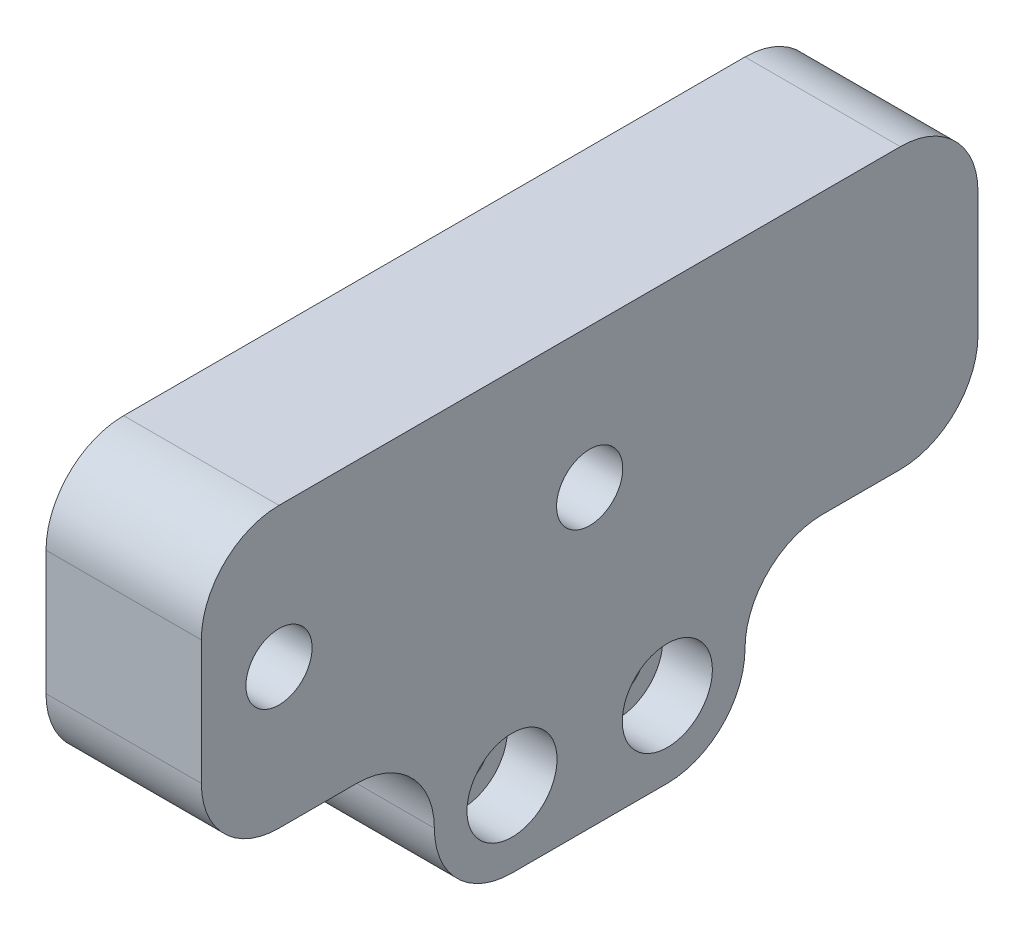
ISO-10303-21;
HEADER;
FILE_DESCRIPTION(('STEP AP214'),'2;1');
FILE_NAME('part.step','',(''),(''),'','','');
FILE_SCHEMA(('AUTOMOTIVE_DESIGN { 1 0 10303 214 1 1 1 1 }'));
ENDSEC;
DATA;
#1=APPLICATION_CONTEXT('core data for automotive mechanical design processes');
#2=APPLICATION_PROTOCOL_DEFINITION('international standard','automotive_design',2000,#1);
#3=PRODUCT_CONTEXT('',#1,'mechanical');
#4=PRODUCT('Part','Part','',(#3));
#5=PRODUCT_RELATED_PRODUCT_CATEGORY('part','',(#4));
#6=PRODUCT_DEFINITION_FORMATION('','',#4);
#7=PRODUCT_DEFINITION_CONTEXT('part definition',#1,'design');
#8=PRODUCT_DEFINITION('design','',#6,#7);
#9=PRODUCT_DEFINITION_SHAPE('','',#8);
#10=(LENGTH_UNIT() NAMED_UNIT(*) SI_UNIT(.MILLI.,.METRE.));
#11=(NAMED_UNIT(*) PLANE_ANGLE_UNIT() SI_UNIT($,.RADIAN.));
#12=(NAMED_UNIT(*) SI_UNIT($,.STERADIAN.) SOLID_ANGLE_UNIT());
#13=UNCERTAINTY_MEASURE_WITH_UNIT(LENGTH_MEASURE(1.E-05),#10,'distance_accuracy_value','');
#14=(GEOMETRIC_REPRESENTATION_CONTEXT(3) GLOBAL_UNCERTAINTY_ASSIGNED_CONTEXT((#13)) GLOBAL_UNIT_ASSIGNED_CONTEXT((#10,
#11,#12)) REPRESENTATION_CONTEXT('',''));
#15=CARTESIAN_POINT('',(0.,0.,0.));
#16=DIRECTION('',(0.,0.,1.));
#17=DIRECTION('',(1.,0.,0.));
#18=AXIS2_PLACEMENT_3D('',#15,#16,#17);
#19=CARTESIAN_POINT('',(6.35,-6.47700000000007,-6.35));
#20=DIRECTION('',(-1.,0.,0.));
#21=DIRECTION('',(0.,-1.,0.));
#22=AXIS2_PLACEMENT_3D('',#19,#20,#21);
#23=CYLINDRICAL_SURFACE('',#22,2.159);
#24=CARTESIAN_POINT('',(-19.05,-6.47700000000006,-6.35));
#25=DIRECTION('',(-1.,0.,0.));
#26=DIRECTION('',(0.,-1.,0.));
#27=AXIS2_PLACEMENT_3D('',#24,#25,#26);
#28=CIRCLE('',#27,2.159);
#29=CARTESIAN_POINT('',(-19.05,-8.63600000000006,-6.35));
#30=VERTEX_POINT('',#29);
#31=EDGE_CURVE('E198',#30,#30,#28,.T.);
#32=ORIENTED_EDGE('',*,*,#31,.T.);
#33=EDGE_LOOP('',(#32));
#34=FACE_BOUND('',#33,.T.);
#35=CARTESIAN_POINT('',(2.286,-6.47700000000007,-6.35));
#36=DIRECTION('',(1.,0.,0.));
#37=DIRECTION('',(0.,1.,0.));
#38=AXIS2_PLACEMENT_3D('',#35,#36,#37);
#39=CIRCLE('',#38,2.159);
#40=CARTESIAN_POINT('',(2.286,-4.31800000000006,-6.35));
#41=VERTEX_POINT('',#40);
#42=EDGE_CURVE('E201',#41,#41,#39,.F.);
#43=ORIENTED_EDGE('',*,*,#42,.F.);
#44=EDGE_LOOP('',(#43));
#45=FACE_BOUND('',#44,.T.);
#46=ADVANCED_FACE('F38',(#34,#45),#23,.F.);
#47=CARTESIAN_POINT('',(6.35,-6.47700000000007,6.35));
#48=DIRECTION('',(-1.,0.,0.));
#49=DIRECTION('',(0.,-1.,0.));
#50=AXIS2_PLACEMENT_3D('',#47,#48,#49);
#51=CYLINDRICAL_SURFACE('',#50,2.159);
#52=CARTESIAN_POINT('',(-19.05,-6.47700000000006,6.35));
#53=DIRECTION('',(-1.,0.,0.));
#54=DIRECTION('',(0.,-1.,0.));
#55=AXIS2_PLACEMENT_3D('',#52,#53,#54);
#56=CIRCLE('',#55,2.159);
#57=CARTESIAN_POINT('',(-19.05,-8.63600000000006,6.35));
#58=VERTEX_POINT('',#57);
#59=EDGE_CURVE('E180',#58,#58,#56,.T.);
#60=ORIENTED_EDGE('',*,*,#59,.T.);
#61=EDGE_LOOP('',(#60));
#62=FACE_BOUND('',#61,.T.);
#63=CARTESIAN_POINT('',(2.286,-6.47700000000007,6.35));
#64=DIRECTION('',(1.,0.,0.));
#65=DIRECTION('',(0.,1.,0.));
#66=AXIS2_PLACEMENT_3D('',#63,#64,#65);
#67=CIRCLE('',#66,2.159);
#68=CARTESIAN_POINT('',(2.286,-4.31800000000007,6.35));
#69=VERTEX_POINT('',#68);
#70=EDGE_CURVE('E302',#69,#69,#67,.T.);
#71=ORIENTED_EDGE('',*,*,#70,.T.);
#72=EDGE_LOOP('',(#71));
#73=FACE_BOUND('',#72,.T.);
#74=ADVANCED_FACE('F437',(#62,#73),#51,.F.);
#75=CARTESIAN_POINT('',(6.35,0.,12.7));
#76=DIRECTION('',(1.,0.,0.));
#77=DIRECTION('',(0.,1.,0.));
#78=AXIS2_PLACEMENT_3D('',#75,#76,#77);
#79=PLANE('',#78);
#80=CARTESIAN_POINT('',(6.35,11.43,25.4));
#81=DIRECTION('',(1.,0.,0.));
#82=DIRECTION('',(0.,1.,0.));
#83=AXIS2_PLACEMENT_3D('',#80,#81,#82);
#84=CIRCLE('',#83,2.7051);
#85=CARTESIAN_POINT('',(6.35,14.1351,25.4));
#86=VERTEX_POINT('',#85);
#87=EDGE_CURVE('E387',#86,#86,#84,.T.);
#88=ORIENTED_EDGE('',*,*,#87,.F.);
#89=EDGE_LOOP('',(#88));
#90=FACE_BOUND('',#89,.T.);
#91=CARTESIAN_POINT('',(6.35,11.43,0.));
#92=DIRECTION('',(1.,0.,0.));
#93=DIRECTION('',(0.,1.,0.));
#94=AXIS2_PLACEMENT_3D('',#91,#92,#93);
#95=CIRCLE('',#94,2.7051);
#96=CARTESIAN_POINT('',(6.35,14.1351,0.));
#97=VERTEX_POINT('',#96);
#98=EDGE_CURVE('E383',#97,#97,#95,.T.);
#99=ORIENTED_EDGE('',*,*,#98,.F.);
#100=EDGE_LOOP('',(#99));
#101=FACE_BOUND('',#100,.T.);
#102=DIRECTION('',(0.,0.,-1.));
#103=VECTOR('',#102,1.);
#104=CARTESIAN_POINT('',(6.35,-12.7,12.7));
#105=LINE('',#104,#103);
#106=CARTESIAN_POINT('',(6.35,-12.7,6.35));
#107=VERTEX_POINT('',#106);
#108=CARTESIAN_POINT('',(6.35,-12.7,-6.35));
#109=VERTEX_POINT('',#108);
#110=EDGE_CURVE('E185',#107,#109,#105,.T.);
#111=ORIENTED_EDGE('',*,*,#110,.T.);
#112=CARTESIAN_POINT('',(6.35,-6.35,-6.35));
#113=DIRECTION('',(1.,0.,0.));
#114=DIRECTION('',(0.,1.,0.));
#115=AXIS2_PLACEMENT_3D('',#112,#113,#114);
#116=CIRCLE('',#115,6.35);
#117=CARTESIAN_POINT('',(6.35,-6.35,-12.7));
#118=VERTEX_POINT('',#117);
#119=EDGE_CURVE('E221',#109,#118,#116,.T.);
#120=ORIENTED_EDGE('',*,*,#119,.T.);
#121=CARTESIAN_POINT('',(6.35,-6.35,-19.05));
#122=DIRECTION('',(1.,0.,0.));
#123=DIRECTION('',(0.,1.,0.));
#124=AXIS2_PLACEMENT_3D('',#121,#122,#123);
#125=CIRCLE('',#124,6.35);
#126=CARTESIAN_POINT('',(6.35,0.,-19.05));
#127=VERTEX_POINT('',#126);
#128=EDGE_CURVE('E261',#118,#127,#125,.F.);
#129=ORIENTED_EDGE('',*,*,#128,.T.);
#130=DIRECTION('',(0.,0.,1.));
#131=VECTOR('',#130,1.);
#132=CARTESIAN_POINT('',(6.35,0.,-31.75));
#133=LINE('',#132,#131);
#134=CARTESIAN_POINT('',(6.35,0.,-25.4));
#135=VERTEX_POINT('',#134);
#136=EDGE_CURVE('E316',#135,#127,#133,.T.);
#137=ORIENTED_EDGE('',*,*,#136,.F.);
#138=CARTESIAN_POINT('',(6.35,6.35,-25.4));
#139=DIRECTION('',(1.,0.,0.));
#140=DIRECTION('',(0.,1.,0.));
#141=AXIS2_PLACEMENT_3D('',#138,#139,#140);
#142=CIRCLE('',#141,6.35);
#143=CARTESIAN_POINT('',(6.35,6.35,-31.75));
#144=VERTEX_POINT('',#143);
#145=EDGE_CURVE('E211',#135,#144,#142,.T.);
#146=ORIENTED_EDGE('',*,*,#145,.T.);
#147=DIRECTION('',(0.,1.,0.));
#148=VECTOR('',#147,1.);
#149=CARTESIAN_POINT('',(6.35,0.,-31.75));
#150=LINE('',#149,#148);
#151=CARTESIAN_POINT('',(6.34999999999999,16.51,-31.75));
#152=VERTEX_POINT('',#151);
#153=EDGE_CURVE('E294',#144,#152,#150,.T.);
#154=ORIENTED_EDGE('',*,*,#153,.T.);
#155=CARTESIAN_POINT('',(6.34999999999999,16.51,-25.4));
#156=DIRECTION('',(1.,0.,0.));
#157=DIRECTION('',(0.,1.,0.));
#158=AXIS2_PLACEMENT_3D('',#155,#156,#157);
#159=CIRCLE('',#158,6.35);
#160=CARTESIAN_POINT('',(6.34999999999999,22.86,-25.4));
#161=VERTEX_POINT('',#160);
#162=EDGE_CURVE('E213',#152,#161,#159,.T.);
#163=ORIENTED_EDGE('',*,*,#162,.T.);
#164=DIRECTION('',(0.,0.,-1.));
#165=VECTOR('',#164,1.);
#166=CARTESIAN_POINT('',(6.34999999999999,22.86,12.7));
#167=LINE('',#166,#165);
#168=CARTESIAN_POINT('',(6.34999999999999,22.86,25.4));
#169=VERTEX_POINT('',#168);
#170=EDGE_CURVE('E188',#169,#161,#167,.T.);
#171=ORIENTED_EDGE('',*,*,#170,.F.);
#172=CARTESIAN_POINT('',(6.34999999999999,16.51,25.4));
#173=DIRECTION('',(1.,0.,0.));
#174=DIRECTION('',(0.,1.,0.));
#175=AXIS2_PLACEMENT_3D('',#172,#173,#174);
#176=CIRCLE('',#175,6.35);
#177=CARTESIAN_POINT('',(6.34999999999999,16.51,31.75));
#178=VERTEX_POINT('',#177);
#179=EDGE_CURVE('E215',#169,#178,#176,.T.);
#180=ORIENTED_EDGE('',*,*,#179,.T.);
#181=DIRECTION('',(0.,1.,0.));
#182=VECTOR('',#181,1.);
#183=CARTESIAN_POINT('',(6.35,0.,31.75));
#184=LINE('',#183,#182);
#185=CARTESIAN_POINT('',(6.35,6.35,31.75));
#186=VERTEX_POINT('',#185);
#187=EDGE_CURVE('E368',#186,#178,#184,.T.);
#188=ORIENTED_EDGE('',*,*,#187,.F.);
#189=CARTESIAN_POINT('',(6.35,6.35,25.4));
#190=DIRECTION('',(1.,0.,0.));
#191=DIRECTION('',(0.,1.,0.));
#192=AXIS2_PLACEMENT_3D('',#189,#190,#191);
#193=CIRCLE('',#192,6.35);
#194=CARTESIAN_POINT('',(6.35,0.,25.4));
#195=VERTEX_POINT('',#194);
#196=EDGE_CURVE('E217',#186,#195,#193,.T.);
#197=ORIENTED_EDGE('',*,*,#196,.T.);
#198=CARTESIAN_POINT('',(6.35,0.,19.05));
#199=VERTEX_POINT('',#198);
#200=EDGE_CURVE('E296',#199,#195,#133,.T.);
#201=ORIENTED_EDGE('',*,*,#200,.F.);
#202=CARTESIAN_POINT('',(6.35,-6.35,19.05));
#203=DIRECTION('',(1.,0.,0.));
#204=DIRECTION('',(0.,1.,0.));
#205=AXIS2_PLACEMENT_3D('',#202,#203,#204);
#206=CIRCLE('',#205,6.35);
#207=CARTESIAN_POINT('',(6.35,-6.35,12.7));
#208=VERTEX_POINT('',#207);
#209=EDGE_CURVE('E47',#199,#208,#206,.F.);
#210=ORIENTED_EDGE('',*,*,#209,.T.);
#211=CARTESIAN_POINT('',(6.35,-6.35,6.35));
#212=DIRECTION('',(1.,0.,0.));
#213=DIRECTION('',(0.,1.,0.));
#214=AXIS2_PLACEMENT_3D('',#211,#212,#213);
#215=CIRCLE('',#214,6.35);
#216=EDGE_CURVE('E219',#208,#107,#215,.T.);
#217=ORIENTED_EDGE('',*,*,#216,.T.);
#218=EDGE_LOOP('',(#111,#120,#129,#137,#146,#154,#163,#171,#180,#188,#197,#201,#210,#217));
#219=FACE_BOUND('',#218,.T.);
#220=CARTESIAN_POINT('',(6.35,-6.47700000000007,6.35));
#221=DIRECTION('',(1.,0.,0.));
#222=DIRECTION('',(0.,1.,0.));
#223=AXIS2_PLACEMENT_3D('',#220,#221,#222);
#224=CIRCLE('',#223,3.683);
#225=CARTESIAN_POINT('',(6.35,-2.79400000000007,6.35));
#226=VERTEX_POINT('',#225);
#227=EDGE_CURVE('E305',#226,#226,#224,.T.);
#228=ORIENTED_EDGE('',*,*,#227,.F.);
#229=EDGE_LOOP('',(#228));
#230=FACE_BOUND('',#229,.T.);
#231=CARTESIAN_POINT('',(6.35,-6.47700000000007,-6.35));
#232=DIRECTION('',(1.,0.,0.));
#233=DIRECTION('',(0.,1.,0.));
#234=AXIS2_PLACEMENT_3D('',#231,#232,#233);
#235=CIRCLE('',#234,3.683);
#236=CARTESIAN_POINT('',(6.35,-2.79400000000007,-6.35));
#237=VERTEX_POINT('',#236);
#238=EDGE_CURVE('E306',#237,#237,#235,.T.);
#239=ORIENTED_EDGE('',*,*,#238,.F.);
#240=EDGE_LOOP('',(#239));
#241=FACE_BOUND('',#240,.T.);
#242=ADVANCED_FACE('F335',(#90,#101,#219,#230,#241),#79,.T.);
#243=CARTESIAN_POINT('',(0.,22.86,12.7));
#244=DIRECTION('',(0.,1.,0.));
#245=DIRECTION('',(0.,0.,1.));
#246=AXIS2_PLACEMENT_3D('',#243,#244,#245);
#247=PLANE('',#246);
#248=DIRECTION('',(0.,0.,-1.));
#249=VECTOR('',#248,1.);
#250=CARTESIAN_POINT('',(-6.35000000000001,22.86,12.7));
#251=LINE('',#250,#249);
#252=CARTESIAN_POINT('',(-6.35000000000001,22.86,25.4));
#253=VERTEX_POINT('',#252);
#254=CARTESIAN_POINT('',(-6.35000000000001,22.86,-25.4));
#255=VERTEX_POINT('',#254);
#256=EDGE_CURVE('E184',#253,#255,#251,.T.);
#257=ORIENTED_EDGE('',*,*,#256,.F.);
#258=DIRECTION('',(-1.,0.,0.));
#259=VECTOR('',#258,1.);
#260=CARTESIAN_POINT('',(0.,22.86,25.4));
#261=LINE('',#260,#259);
#262=EDGE_CURVE('E251',#253,#169,#261,.F.);
#263=ORIENTED_EDGE('',*,*,#262,.T.);
#264=ORIENTED_EDGE('',*,*,#170,.T.);
#265=DIRECTION('',(-1.,0.,0.));
#266=VECTOR('',#265,1.);
#267=CARTESIAN_POINT('',(-6.35000000000001,22.86,-25.4));
#268=LINE('',#267,#266);
#269=EDGE_CURVE('E248',#161,#255,#268,.T.);
#270=ORIENTED_EDGE('',*,*,#269,.T.);
#271=EDGE_LOOP('',(#257,#263,#264,#270));
#272=FACE_BOUND('',#271,.T.);
#273=ADVANCED_FACE('F362',(#272),#247,.T.);
#274=CARTESIAN_POINT('',(-6.35,0.,12.7));
#275=DIRECTION('',(1.,0.,0.));
#276=DIRECTION('',(0.,1.,0.));
#277=AXIS2_PLACEMENT_3D('',#274,#275,#276);
#278=PLANE('',#277);
#279=CARTESIAN_POINT('',(-6.35,5.08,-26.67));
#280=DIRECTION('',(-1.,0.,0.));
#281=DIRECTION('',(0.,-1.,0.));
#282=AXIS2_PLACEMENT_3D('',#279,#280,#281);
#283=CIRCLE('',#282,1.143);
#284=CARTESIAN_POINT('',(-6.35,3.937,-26.67));
#285=VERTEX_POINT('',#284);
#286=EDGE_CURVE('E272',#285,#285,#283,.T.);
#287=ORIENTED_EDGE('',*,*,#286,.F.);
#288=EDGE_LOOP('',(#287));
#289=FACE_BOUND('',#288,.T.);
#290=CARTESIAN_POINT('',(-6.35,5.08000000000001,-6.35000000000002));
#291=DIRECTION('',(-1.,0.,0.));
#292=DIRECTION('',(0.,-1.,0.));
#293=AXIS2_PLACEMENT_3D('',#290,#291,#292);
#294=CIRCLE('',#293,1.143);
#295=CARTESIAN_POINT('',(-6.35,3.93700000000001,-6.35000000000002));
#296=VERTEX_POINT('',#295);
#297=EDGE_CURVE('E403',#296,#296,#294,.T.);
#298=ORIENTED_EDGE('',*,*,#297,.F.);
#299=EDGE_LOOP('',(#298));
#300=FACE_BOUND('',#299,.T.);
#301=CARTESIAN_POINT('',(-6.35000000000001,17.78,-6.35000000000002));
#302=DIRECTION('',(-1.,0.,0.));
#303=DIRECTION('',(0.,-1.,0.));
#304=AXIS2_PLACEMENT_3D('',#301,#302,#303);
#305=CIRCLE('',#304,1.143);
#306=CARTESIAN_POINT('',(-6.35000000000001,16.637,-6.35000000000002));
#307=VERTEX_POINT('',#306);
#308=EDGE_CURVE('E395',#307,#307,#305,.T.);
#309=ORIENTED_EDGE('',*,*,#308,.F.);
#310=EDGE_LOOP('',(#309));
#311=FACE_BOUND('',#310,.T.);
#312=CARTESIAN_POINT('',(-6.35000000000001,17.78,-26.67));
#313=DIRECTION('',(-1.,0.,0.));
#314=DIRECTION('',(0.,-1.,0.));
#315=AXIS2_PLACEMENT_3D('',#312,#313,#314);
#316=CIRCLE('',#315,1.143);
#317=CARTESIAN_POINT('',(-6.35000000000001,16.637,-26.67));
#318=VERTEX_POINT('',#317);
#319=EDGE_CURVE('E392',#318,#318,#316,.T.);
#320=ORIENTED_EDGE('',*,*,#319,.F.);
#321=EDGE_LOOP('',(#320));
#322=FACE_BOUND('',#321,.T.);
#323=DIRECTION('',(0.,0.,1.));
#324=VECTOR('',#323,1.);
#325=CARTESIAN_POINT('',(-6.35,0.,-31.75));
#326=LINE('',#325,#324);
#327=CARTESIAN_POINT('',(-6.35,0.,19.05));
#328=VERTEX_POINT('',#327);
#329=CARTESIAN_POINT('',(-6.35,0.,25.4));
#330=VERTEX_POINT('',#329);
#331=EDGE_CURVE('E286',#328,#330,#326,.T.);
#332=ORIENTED_EDGE('',*,*,#331,.T.);
#333=CARTESIAN_POINT('',(-6.35,6.35,25.4));
#334=DIRECTION('',(1.,0.,0.));
#335=DIRECTION('',(0.,1.,0.));
#336=AXIS2_PLACEMENT_3D('',#333,#334,#335);
#337=CIRCLE('',#336,6.35);
#338=CARTESIAN_POINT('',(-6.35,6.35,31.75));
#339=VERTEX_POINT('',#338);
#340=EDGE_CURVE('E246',#330,#339,#337,.F.);
#341=ORIENTED_EDGE('',*,*,#340,.T.);
#342=DIRECTION('',(0.,-1.,0.));
#343=VECTOR('',#342,1.);
#344=CARTESIAN_POINT('',(-6.35,0.,31.75));
#345=LINE('',#344,#343);
#346=CARTESIAN_POINT('',(-6.35000000000001,16.51,31.75));
#347=VERTEX_POINT('',#346);
#348=EDGE_CURVE('E374',#347,#339,#345,.T.);
#349=ORIENTED_EDGE('',*,*,#348,.F.);
#350=CARTESIAN_POINT('',(-6.35000000000001,16.51,25.4));
#351=DIRECTION('',(1.,0.,0.));
#352=DIRECTION('',(0.,1.,0.));
#353=AXIS2_PLACEMENT_3D('',#350,#351,#352);
#354=CIRCLE('',#353,6.35);
#355=EDGE_CURVE('E244',#347,#253,#354,.F.);
#356=ORIENTED_EDGE('',*,*,#355,.T.);
#357=ORIENTED_EDGE('',*,*,#256,.T.);
#358=CARTESIAN_POINT('',(-6.35000000000001,16.51,-25.4));
#359=DIRECTION('',(1.,0.,0.));
#360=DIRECTION('',(0.,1.,0.));
#361=AXIS2_PLACEMENT_3D('',#358,#359,#360);
#362=CIRCLE('',#361,6.35);
#363=CARTESIAN_POINT('',(-6.35000000000001,16.51,-31.75));
#364=VERTEX_POINT('',#363);
#365=EDGE_CURVE('E242',#255,#364,#362,.F.);
#366=ORIENTED_EDGE('',*,*,#365,.T.);
#367=DIRECTION('',(0.,-1.,0.));
#368=VECTOR('',#367,1.);
#369=CARTESIAN_POINT('',(-6.35,0.,-31.75));
#370=LINE('',#369,#368);
#371=CARTESIAN_POINT('',(-6.35,6.35,-31.75));
#372=VERTEX_POINT('',#371);
#373=EDGE_CURVE('E298',#364,#372,#370,.T.);
#374=ORIENTED_EDGE('',*,*,#373,.T.);
#375=CARTESIAN_POINT('',(-6.35,6.35,-25.4));
#376=DIRECTION('',(1.,0.,0.));
#377=DIRECTION('',(0.,1.,0.));
#378=AXIS2_PLACEMENT_3D('',#375,#376,#377);
#379=CIRCLE('',#378,6.35);
#380=CARTESIAN_POINT('',(-6.35,0.,-25.4));
#381=VERTEX_POINT('',#380);
#382=EDGE_CURVE('E240',#372,#381,#379,.F.);
#383=ORIENTED_EDGE('',*,*,#382,.T.);
#384=CARTESIAN_POINT('',(-6.35,0.,-19.05));
#385=VERTEX_POINT('',#384);
#386=EDGE_CURVE('E293',#381,#385,#326,.T.);
#387=ORIENTED_EDGE('',*,*,#386,.T.);
#388=CARTESIAN_POINT('',(-6.35,-6.35,-19.05));
#389=DIRECTION('',(1.,0.,0.));
#390=DIRECTION('',(0.,1.,0.));
#391=AXIS2_PLACEMENT_3D('',#388,#389,#390);
#392=CIRCLE('',#391,6.35);
#393=CARTESIAN_POINT('',(-6.35,-6.35,-12.7));
#394=VERTEX_POINT('',#393);
#395=EDGE_CURVE('E263',#385,#394,#392,.T.);
#396=ORIENTED_EDGE('',*,*,#395,.T.);
#397=DIRECTION('',(0.,-1.,0.));
#398=VECTOR('',#397,1.);
#399=CARTESIAN_POINT('',(-6.35,0.,-12.7));
#400=LINE('',#399,#398);
#401=CARTESIAN_POINT('',(-6.35,0.,-12.7));
#402=VERTEX_POINT('',#401);
#403=EDGE_CURVE('E55',#402,#394,#400,.T.);
#404=ORIENTED_EDGE('',*,*,#403,.F.);
#405=DIRECTION('',(0.,0.,-1.));
#406=VECTOR('',#405,1.);
#407=CARTESIAN_POINT('',(-6.35,0.,12.7));
#408=LINE('',#407,#406);
#409=CARTESIAN_POINT('',(-6.35,0.,12.7));
#410=VERTEX_POINT('',#409);
#411=EDGE_CURVE('E175',#410,#402,#408,.T.);
#412=ORIENTED_EDGE('',*,*,#411,.F.);
#413=DIRECTION('',(0.,1.,0.));
#414=VECTOR('',#413,1.);
#415=CARTESIAN_POINT('',(-6.35,0.,12.7));
#416=LINE('',#415,#414);
#417=CARTESIAN_POINT('',(-6.35,-6.35,12.7));
#418=VERTEX_POINT('',#417);
#419=EDGE_CURVE('E161',#418,#410,#416,.T.);
#420=ORIENTED_EDGE('',*,*,#419,.F.);
#421=CARTESIAN_POINT('',(-6.35,-6.35,19.05));
#422=DIRECTION('',(1.,0.,0.));
#423=DIRECTION('',(0.,1.,0.));
#424=AXIS2_PLACEMENT_3D('',#421,#422,#423);
#425=CIRCLE('',#424,6.35);
#426=EDGE_CURVE('E11',#418,#328,#425,.T.);
#427=ORIENTED_EDGE('',*,*,#426,.T.);
#428=EDGE_LOOP('',(#332,#341,#349,#356,#357,#366,#374,#383,#387,#396,#404,#412,#420,#427));
#429=FACE_BOUND('',#428,.T.);
#430=ADVANCED_FACE('F183',(#289,#300,#311,#322,#429),#278,.F.);
#431=CARTESIAN_POINT('',(0.,-12.7,12.7));
#432=DIRECTION('',(0.,1.,0.));
#433=DIRECTION('',(-1.,0.,0.));
#434=AXIS2_PLACEMENT_3D('',#431,#432,#433);
#435=PLANE('',#434);
#436=DIRECTION('',(0.,0.,1.));
#437=VECTOR('',#436,1.);
#438=CARTESIAN_POINT('',(-19.05,-12.7,-35.5952505991963));
#439=LINE('',#438,#437);
#440=CARTESIAN_POINT('',(-19.05,-12.7,-6.35));
#441=VERTEX_POINT('',#440);
#442=CARTESIAN_POINT('',(-19.05,-12.7,6.35));
#443=VERTEX_POINT('',#442);
#444=EDGE_CURVE('E318',#441,#443,#439,.T.);
#445=ORIENTED_EDGE('',*,*,#444,.F.);
#446=DIRECTION('',(1.,0.,0.));
#447=VECTOR('',#446,1.);
#448=CARTESIAN_POINT('',(0.,-12.7,-6.35));
#449=LINE('',#448,#447);
#450=EDGE_CURVE('E208',#441,#109,#449,.T.);
#451=ORIENTED_EDGE('',*,*,#450,.T.);
#452=ORIENTED_EDGE('',*,*,#110,.F.);
#453=DIRECTION('',(1.,0.,0.));
#454=VECTOR('',#453,1.);
#455=CARTESIAN_POINT('',(-19.05,-12.7,6.35));
#456=LINE('',#455,#454);
#457=EDGE_CURVE('E197',#107,#443,#456,.F.);
#458=ORIENTED_EDGE('',*,*,#457,.T.);
#459=EDGE_LOOP('',(#445,#451,#452,#458));
#460=FACE_BOUND('',#459,.T.);
#461=ADVANCED_FACE('F332',(#460),#435,.F.);
#462=CARTESIAN_POINT('',(0.,0.,12.7));
#463=DIRECTION('',(0.,0.,1.));
#464=DIRECTION('',(1.,0.,0.));
#465=AXIS2_PLACEMENT_3D('',#462,#463,#464);
#466=PLANE('',#465);
#467=DIRECTION('',(0.,-1.,0.));
#468=VECTOR('',#467,1.);
#469=CARTESIAN_POINT('',(-19.05,0.,12.7));
#470=LINE('',#469,#468);
#471=CARTESIAN_POINT('',(-19.05,0.,12.7));
#472=VERTEX_POINT('',#471);
#473=CARTESIAN_POINT('',(-19.05,-6.34999999999999,12.7));
#474=VERTEX_POINT('',#473);
#475=EDGE_CURVE('E179',#472,#474,#470,.T.);
#476=ORIENTED_EDGE('',*,*,#475,.T.);
#477=DIRECTION('',(1.,0.,0.));
#478=VECTOR('',#477,1.);
#479=CARTESIAN_POINT('',(6.35,-6.35,12.7));
#480=LINE('',#479,#478);
#481=EDGE_CURVE('E168',#474,#418,#480,.T.);
#482=ORIENTED_EDGE('',*,*,#481,.T.);
#483=ORIENTED_EDGE('',*,*,#419,.T.);
#484=DIRECTION('',(-1.,0.,0.));
#485=VECTOR('',#484,1.);
#486=CARTESIAN_POINT('',(0.,0.,12.7));
#487=LINE('',#486,#485);
#488=EDGE_CURVE('E165',#410,#472,#487,.T.);
#489=ORIENTED_EDGE('',*,*,#488,.T.);
#490=EDGE_LOOP('',(#476,#482,#483,#489));
#491=FACE_BOUND('',#490,.T.);
#492=ADVANCED_FACE('F164',(#491),#466,.T.);
#493=CARTESIAN_POINT('',(0.,0.,-12.7));
#494=DIRECTION('',(0.,0.,1.));
#495=DIRECTION('',(1.,0.,0.));
#496=AXIS2_PLACEMENT_3D('',#493,#494,#495);
#497=PLANE('',#496);
#498=ORIENTED_EDGE('',*,*,#403,.T.);
#499=DIRECTION('',(1.,0.,0.));
#500=VECTOR('',#499,1.);
#501=CARTESIAN_POINT('',(0.,-6.35,-12.7));
#502=LINE('',#501,#500);
#503=CARTESIAN_POINT('',(-19.05,-6.34999999999999,-12.7));
#504=VERTEX_POINT('',#503);
#505=EDGE_CURVE('E224',#394,#504,#502,.F.);
#506=ORIENTED_EDGE('',*,*,#505,.T.);
#507=DIRECTION('',(0.,1.,0.));
#508=VECTOR('',#507,1.);
#509=CARTESIAN_POINT('',(-19.05,0.,-12.7));
#510=LINE('',#509,#508);
#511=CARTESIAN_POINT('',(-19.05,0.,-12.7));
#512=VERTEX_POINT('',#511);
#513=EDGE_CURVE('E317',#504,#512,#510,.T.);
#514=ORIENTED_EDGE('',*,*,#513,.T.);
#515=DIRECTION('',(1.,0.,0.));
#516=VECTOR('',#515,1.);
#517=CARTESIAN_POINT('',(0.,0.,-12.7));
#518=LINE('',#517,#516);
#519=EDGE_CURVE('E191',#512,#402,#518,.T.);
#520=ORIENTED_EDGE('',*,*,#519,.T.);
#521=EDGE_LOOP('',(#498,#506,#514,#520));
#522=FACE_BOUND('',#521,.T.);
#523=ADVANCED_FACE('F324',(#522),#497,.F.);
#524=CARTESIAN_POINT('',(0.,0.,-35.5952505991963));
#525=DIRECTION('',(0.,1.,0.));
#526=DIRECTION('',(-1.,0.,0.));
#527=AXIS2_PLACEMENT_3D('',#524,#525,#526);
#528=PLANE('',#527);
#529=ORIENTED_EDGE('',*,*,#411,.T.);
#530=ORIENTED_EDGE('',*,*,#519,.F.);
#531=DIRECTION('',(0.,0.,1.));
#532=VECTOR('',#531,1.);
#533=CARTESIAN_POINT('',(-19.05,0.,-35.5952505991963));
#534=LINE('',#533,#532);
#535=EDGE_CURVE('E177',#512,#472,#534,.T.);
#536=ORIENTED_EDGE('',*,*,#535,.T.);
#537=ORIENTED_EDGE('',*,*,#488,.F.);
#538=EDGE_LOOP('',(#529,#530,#536,#537));
#539=FACE_BOUND('',#538,.T.);
#540=ADVANCED_FACE('F173',(#539),#528,.T.);
#541=CARTESIAN_POINT('',(-19.05,0.,-35.5952505991963));
#542=DIRECTION('',(-1.,0.,0.));
#543=DIRECTION('',(0.,-1.,0.));
#544=AXIS2_PLACEMENT_3D('',#541,#542,#543);
#545=PLANE('',#544);
#546=ORIENTED_EDGE('',*,*,#59,.F.);
#547=EDGE_LOOP('',(#546));
#548=FACE_BOUND('',#547,.T.);
#549=ORIENTED_EDGE('',*,*,#31,.F.);
#550=EDGE_LOOP('',(#549));
#551=FACE_BOUND('',#550,.T.);
#552=ORIENTED_EDGE('',*,*,#513,.F.);
#553=CARTESIAN_POINT('',(-19.05,-6.34999999999999,-6.35));
#554=DIRECTION('',(-1.,0.,0.));
#555=DIRECTION('',(0.,-1.,0.));
#556=AXIS2_PLACEMENT_3D('',#553,#554,#555);
#557=CIRCLE('',#556,6.35);
#558=EDGE_CURVE('E169',#504,#441,#557,.T.);
#559=ORIENTED_EDGE('',*,*,#558,.T.);
#560=ORIENTED_EDGE('',*,*,#444,.T.);
#561=CARTESIAN_POINT('',(-19.05,-6.34999999999999,6.35));
#562=DIRECTION('',(-1.,0.,0.));
#563=DIRECTION('',(0.,-1.,0.));
#564=AXIS2_PLACEMENT_3D('',#561,#562,#563);
#565=CIRCLE('',#564,6.35);
#566=EDGE_CURVE('E226',#443,#474,#565,.T.);
#567=ORIENTED_EDGE('',*,*,#566,.T.);
#568=ORIENTED_EDGE('',*,*,#475,.F.);
#569=ORIENTED_EDGE('',*,*,#535,.F.);
#570=EDGE_LOOP('',(#552,#559,#560,#567,#568,#569));
#571=FACE_BOUND('',#570,.T.);
#572=ADVANCED_FACE('F328',(#548,#551,#571),#545,.T.);
#573=CARTESIAN_POINT('',(2.286,-6.47700000000007,6.35));
#574=DIRECTION('',(1.,0.,0.));
#575=DIRECTION('',(0.,1.,0.));
#576=AXIS2_PLACEMENT_3D('',#573,#574,#575);
#577=CYLINDRICAL_SURFACE('',#576,3.683);
#578=CARTESIAN_POINT('',(2.286,-6.47700000000007,6.35));
#579=DIRECTION('',(1.,0.,0.));
#580=DIRECTION('',(0.,1.,0.));
#581=AXIS2_PLACEMENT_3D('',#578,#579,#580);
#582=CIRCLE('',#581,3.683);
#583=CARTESIAN_POINT('',(2.286,-2.79400000000007,6.35));
#584=VERTEX_POINT('',#583);
#585=EDGE_CURVE('E206',#584,#584,#582,.T.);
#586=ORIENTED_EDGE('',*,*,#585,.F.);
#587=EDGE_LOOP('',(#586));
#588=FACE_BOUND('',#587,.T.);
#589=ORIENTED_EDGE('',*,*,#227,.T.);
#590=EDGE_LOOP('',(#589));
#591=FACE_BOUND('',#590,.T.);
#592=ADVANCED_FACE('F450',(#588,#591),#577,.F.);
#593=CARTESIAN_POINT('',(2.286,-6.47700000000007,6.35));
#594=DIRECTION('',(1.,0.,0.));
#595=DIRECTION('',(0.,1.,0.));
#596=AXIS2_PLACEMENT_3D('',#593,#594,#595);
#597=PLANE('',#596);
#598=ORIENTED_EDGE('',*,*,#70,.F.);
#599=EDGE_LOOP('',(#598));
#600=FACE_BOUND('',#599,.T.);
#601=ORIENTED_EDGE('',*,*,#585,.T.);
#602=EDGE_LOOP('',(#601));
#603=FACE_BOUND('',#602,.T.);
#604=ADVANCED_FACE('F763',(#600,#603),#597,.T.);
#605=CARTESIAN_POINT('',(2.286,-6.47700000000007,-6.35));
#606=DIRECTION('',(1.,0.,0.));
#607=DIRECTION('',(0.,1.,0.));
#608=AXIS2_PLACEMENT_3D('',#605,#606,#607);
#609=PLANE('',#608);
#610=CARTESIAN_POINT('',(2.286,-6.47700000000007,-6.35));
#611=DIRECTION('',(1.,0.,0.));
#612=DIRECTION('',(0.,1.,0.));
#613=AXIS2_PLACEMENT_3D('',#610,#611,#612);
#614=CIRCLE('',#613,3.683);
#615=CARTESIAN_POINT('',(2.286,-2.79400000000007,-6.35));
#616=VERTEX_POINT('',#615);
#617=EDGE_CURVE('E313',#616,#616,#614,.T.);
#618=ORIENTED_EDGE('',*,*,#617,.T.);
#619=EDGE_LOOP('',(#618));
#620=FACE_BOUND('',#619,.T.);
#621=ORIENTED_EDGE('',*,*,#42,.T.);
#622=EDGE_LOOP('',(#621));
#623=FACE_BOUND('',#622,.T.);
#624=ADVANCED_FACE('F752',(#620,#623),#609,.T.);
#625=CARTESIAN_POINT('',(2.286,-6.47700000000007,-6.35));
#626=DIRECTION('',(1.,0.,0.));
#627=DIRECTION('',(0.,1.,0.));
#628=AXIS2_PLACEMENT_3D('',#625,#626,#627);
#629=CYLINDRICAL_SURFACE('',#628,3.683);
#630=ORIENTED_EDGE('',*,*,#617,.F.);
#631=EDGE_LOOP('',(#630));
#632=FACE_BOUND('',#631,.T.);
#633=ORIENTED_EDGE('',*,*,#238,.T.);
#634=EDGE_LOOP('',(#633));
#635=FACE_BOUND('',#634,.T.);
#636=ADVANCED_FACE('F574',(#632,#635),#629,.F.);
#637=CARTESIAN_POINT('',(0.,0.,-31.75));
#638=DIRECTION('',(0.,0.,1.));
#639=DIRECTION('',(1.,0.,0.));
#640=AXIS2_PLACEMENT_3D('',#637,#638,#639);
#641=PLANE('',#640);
#642=ORIENTED_EDGE('',*,*,#373,.F.);
#643=DIRECTION('',(-1.,0.,0.));
#644=VECTOR('',#643,1.);
#645=CARTESIAN_POINT('',(6.34999999999999,16.51,-31.75));
#646=LINE('',#645,#644);
#647=EDGE_CURVE('E255',#364,#152,#646,.F.);
#648=ORIENTED_EDGE('',*,*,#647,.T.);
#649=ORIENTED_EDGE('',*,*,#153,.F.);
#650=DIRECTION('',(1.,0.,0.));
#651=VECTOR('',#650,1.);
#652=CARTESIAN_POINT('',(-6.35,6.35,-31.75));
#653=LINE('',#652,#651);
#654=EDGE_CURVE('E253',#144,#372,#653,.F.);
#655=ORIENTED_EDGE('',*,*,#654,.T.);
#656=EDGE_LOOP('',(#642,#648,#649,#655));
#657=FACE_BOUND('',#656,.T.);
#658=ADVANCED_FACE('F353',(#657),#641,.F.);
#659=CARTESIAN_POINT('',(0.,0.,-31.75));
#660=DIRECTION('',(0.,-1.,0.));
#661=DIRECTION('',(1.,0.,0.));
#662=AXIS2_PLACEMENT_3D('',#659,#660,#661);
#663=PLANE('',#662);
#664=ORIENTED_EDGE('',*,*,#386,.F.);
#665=DIRECTION('',(1.,0.,0.));
#666=VECTOR('',#665,1.);
#667=CARTESIAN_POINT('',(6.35,0.,-25.4));
#668=LINE('',#667,#666);
#669=EDGE_CURVE('E258',#381,#135,#668,.T.);
#670=ORIENTED_EDGE('',*,*,#669,.T.);
#671=ORIENTED_EDGE('',*,*,#136,.T.);
#672=DIRECTION('',(1.,0.,0.));
#673=VECTOR('',#672,1.);
#674=CARTESIAN_POINT('',(0.,0.,-19.05));
#675=LINE('',#674,#673);
#676=EDGE_CURVE('E63',#127,#385,#675,.F.);
#677=ORIENTED_EDGE('',*,*,#676,.T.);
#678=EDGE_LOOP('',(#664,#670,#671,#677));
#679=FACE_BOUND('',#678,.T.);
#680=ADVANCED_FACE('F340',(#679),#663,.T.);
#681=ORIENTED_EDGE('',*,*,#200,.T.);
#682=DIRECTION('',(1.,0.,0.));
#683=VECTOR('',#682,1.);
#684=CARTESIAN_POINT('',(0.,0.,25.4));
#685=LINE('',#684,#683);
#686=EDGE_CURVE('E238',#195,#330,#685,.F.);
#687=ORIENTED_EDGE('',*,*,#686,.T.);
#688=ORIENTED_EDGE('',*,*,#331,.F.);
#689=DIRECTION('',(1.,0.,0.));
#690=VECTOR('',#689,1.);
#691=CARTESIAN_POINT('',(6.35,0.,19.05));
#692=LINE('',#691,#690);
#693=EDGE_CURVE('E236',#328,#199,#692,.T.);
#694=ORIENTED_EDGE('',*,*,#693,.T.);
#695=EDGE_LOOP('',(#681,#687,#688,#694));
#696=FACE_BOUND('',#695,.T.);
#697=ADVANCED_FACE('F290',(#696),#663,.T.);
#698=CARTESIAN_POINT('',(0.,0.,31.75));
#699=DIRECTION('',(0.,0.,1.));
#700=DIRECTION('',(1.,0.,0.));
#701=AXIS2_PLACEMENT_3D('',#698,#699,#700);
#702=PLANE('',#701);
#703=ORIENTED_EDGE('',*,*,#348,.T.);
#704=DIRECTION('',(1.,0.,0.));
#705=VECTOR('',#704,1.);
#706=CARTESIAN_POINT('',(0.,6.35,31.75));
#707=LINE('',#706,#705);
#708=EDGE_CURVE('E233',#339,#186,#707,.T.);
#709=ORIENTED_EDGE('',*,*,#708,.T.);
#710=ORIENTED_EDGE('',*,*,#187,.T.);
#711=DIRECTION('',(-1.,0.,0.));
#712=VECTOR('',#711,1.);
#713=CARTESIAN_POINT('',(0.,16.51,31.75));
#714=LINE('',#713,#712);
#715=EDGE_CURVE('E230',#178,#347,#714,.T.);
#716=ORIENTED_EDGE('',*,*,#715,.T.);
#717=EDGE_LOOP('',(#703,#709,#710,#716));
#718=FACE_BOUND('',#717,.T.);
#719=ADVANCED_FACE('F371',(#718),#702,.T.);
#720=CARTESIAN_POINT('',(-2.54,11.43,0.));
#721=DIRECTION('',(1.,0.,0.));
#722=DIRECTION('',(0.,1.,0.));
#723=AXIS2_PLACEMENT_3D('',#720,#721,#722);
#724=CYLINDRICAL_SURFACE('',#723,2.7051);
#725=CARTESIAN_POINT('',(-2.54,11.43,0.));
#726=DIRECTION('',(1.,0.,0.));
#727=DIRECTION('',(0.,1.,0.));
#728=AXIS2_PLACEMENT_3D('',#725,#726,#727);
#729=CIRCLE('',#728,2.7051);
#730=CARTESIAN_POINT('',(-2.54,14.1351,0.));
#731=VERTEX_POINT('',#730);
#732=EDGE_CURVE('E380',#731,#731,#729,.T.);
#733=ORIENTED_EDGE('',*,*,#732,.F.);
#734=EDGE_LOOP('',(#733));
#735=FACE_BOUND('',#734,.T.);
#736=ORIENTED_EDGE('',*,*,#98,.T.);
#737=EDGE_LOOP('',(#736));
#738=FACE_BOUND('',#737,.T.);
#739=ADVANCED_FACE('F545',(#735,#738),#724,.F.);
#740=CARTESIAN_POINT('',(-2.54,11.43,0.));
#741=DIRECTION('',(1.,0.,0.));
#742=DIRECTION('',(0.,1.,0.));
#743=AXIS2_PLACEMENT_3D('',#740,#741,#742);
#744=PLANE('',#743);
#745=ORIENTED_EDGE('',*,*,#732,.T.);
#746=EDGE_LOOP('',(#745));
#747=FACE_BOUND('',#746,.T.);
#748=ADVANCED_FACE('F719',(#747),#744,.T.);
#749=CARTESIAN_POINT('',(-2.54,11.43,25.4));
#750=DIRECTION('',(1.,0.,0.));
#751=DIRECTION('',(0.,1.,0.));
#752=AXIS2_PLACEMENT_3D('',#749,#750,#751);
#753=CYLINDRICAL_SURFACE('',#752,2.7051);
#754=CARTESIAN_POINT('',(-2.54,11.43,25.4));
#755=DIRECTION('',(1.,0.,0.));
#756=DIRECTION('',(0.,1.,0.));
#757=AXIS2_PLACEMENT_3D('',#754,#755,#756);
#758=CIRCLE('',#757,2.7051);
#759=CARTESIAN_POINT('',(-2.54,14.1351,25.4));
#760=VERTEX_POINT('',#759);
#761=EDGE_CURVE('E377',#760,#760,#758,.T.);
#762=ORIENTED_EDGE('',*,*,#761,.F.);
#763=EDGE_LOOP('',(#762));
#764=FACE_BOUND('',#763,.T.);
#765=ORIENTED_EDGE('',*,*,#87,.T.);
#766=EDGE_LOOP('',(#765));
#767=FACE_BOUND('',#766,.T.);
#768=ADVANCED_FACE('F432',(#764,#767),#753,.F.);
#769=CARTESIAN_POINT('',(-2.54,11.43,25.4));
#770=DIRECTION('',(1.,0.,0.));
#771=DIRECTION('',(0.,1.,0.));
#772=AXIS2_PLACEMENT_3D('',#769,#770,#771);
#773=PLANE('',#772);
#774=ORIENTED_EDGE('',*,*,#761,.T.);
#775=EDGE_LOOP('',(#774));
#776=FACE_BOUND('',#775,.T.);
#777=ADVANCED_FACE('F423',(#776),#773,.T.);
#778=CARTESIAN_POINT('',(2.53999999999999,17.78,-26.67));
#779=DIRECTION('',(-1.,0.,0.));
#780=DIRECTION('',(0.,-1.,0.));
#781=AXIS2_PLACEMENT_3D('',#778,#779,#780);
#782=CYLINDRICAL_SURFACE('',#781,1.143);
#783=CARTESIAN_POINT('',(2.53999999999999,17.78,-26.67));
#784=DIRECTION('',(-1.,0.,0.));
#785=DIRECTION('',(0.,-1.,0.));
#786=AXIS2_PLACEMENT_3D('',#783,#784,#785);
#787=CIRCLE('',#786,1.143);
#788=CARTESIAN_POINT('',(2.53999999999999,16.637,-26.67));
#789=VERTEX_POINT('',#788);
#790=EDGE_CURVE('E384',#789,#789,#787,.T.);
#791=ORIENTED_EDGE('',*,*,#790,.F.);
#792=EDGE_LOOP('',(#791));
#793=FACE_BOUND('',#792,.T.);
#794=ORIENTED_EDGE('',*,*,#319,.T.);
#795=EDGE_LOOP('',(#794));
#796=FACE_BOUND('',#795,.T.);
#797=ADVANCED_FACE('F420',(#793,#796),#782,.F.);
#798=CARTESIAN_POINT('',(2.53999999999999,17.78,-26.67));
#799=DIRECTION('',(-1.,0.,0.));
#800=DIRECTION('',(0.,-1.,0.));
#801=AXIS2_PLACEMENT_3D('',#798,#799,#800);
#802=PLANE('',#801);
#803=ORIENTED_EDGE('',*,*,#790,.T.);
#804=EDGE_LOOP('',(#803));
#805=FACE_BOUND('',#804,.T.);
#806=ADVANCED_FACE('F422',(#805),#802,.T.);
#807=CARTESIAN_POINT('',(2.53999999999999,17.78,-6.35000000000002));
#808=DIRECTION('',(-1.,0.,0.));
#809=DIRECTION('',(0.,-1.,0.));
#810=AXIS2_PLACEMENT_3D('',#807,#808,#809);
#811=CYLINDRICAL_SURFACE('',#810,1.143);
#812=CARTESIAN_POINT('',(2.53999999999999,17.78,-6.35000000000002));
#813=DIRECTION('',(-1.,0.,0.));
#814=DIRECTION('',(0.,-1.,0.));
#815=AXIS2_PLACEMENT_3D('',#812,#813,#814);
#816=CIRCLE('',#815,1.143);
#817=CARTESIAN_POINT('',(2.53999999999999,16.637,-6.35000000000002));
#818=VERTEX_POINT('',#817);
#819=EDGE_CURVE('E406',#818,#818,#816,.T.);
#820=ORIENTED_EDGE('',*,*,#819,.F.);
#821=EDGE_LOOP('',(#820));
#822=FACE_BOUND('',#821,.T.);
#823=ORIENTED_EDGE('',*,*,#308,.T.);
#824=EDGE_LOOP('',(#823));
#825=FACE_BOUND('',#824,.T.);
#826=ADVANCED_FACE('F412',(#822,#825),#811,.F.);
#827=CARTESIAN_POINT('',(2.53999999999999,17.78,-6.35000000000002));
#828=DIRECTION('',(-1.,0.,0.));
#829=DIRECTION('',(0.,-1.,0.));
#830=AXIS2_PLACEMENT_3D('',#827,#828,#829);
#831=PLANE('',#830);
#832=ORIENTED_EDGE('',*,*,#819,.T.);
#833=EDGE_LOOP('',(#832));
#834=FACE_BOUND('',#833,.T.);
#835=ADVANCED_FACE('F669',(#834),#831,.T.);
#836=CARTESIAN_POINT('',(2.54,5.08000000000001,-6.35000000000002));
#837=DIRECTION('',(-1.,0.,0.));
#838=DIRECTION('',(0.,-1.,0.));
#839=AXIS2_PLACEMENT_3D('',#836,#837,#838);
#840=CYLINDRICAL_SURFACE('',#839,1.143);
#841=CARTESIAN_POINT('',(2.54,5.08000000000001,-6.35000000000002));
#842=DIRECTION('',(-1.,0.,0.));
#843=DIRECTION('',(0.,-1.,0.));
#844=AXIS2_PLACEMENT_3D('',#841,#842,#843);
#845=CIRCLE('',#844,1.143);
#846=CARTESIAN_POINT('',(2.54,3.93700000000001,-6.35000000000002));
#847=VERTEX_POINT('',#846);
#848=EDGE_CURVE('E400',#847,#847,#845,.T.);
#849=ORIENTED_EDGE('',*,*,#848,.F.);
#850=EDGE_LOOP('',(#849));
#851=FACE_BOUND('',#850,.T.);
#852=ORIENTED_EDGE('',*,*,#297,.T.);
#853=EDGE_LOOP('',(#852));
#854=FACE_BOUND('',#853,.T.);
#855=ADVANCED_FACE('F658',(#851,#854),#840,.F.);
#856=CARTESIAN_POINT('',(2.54,5.08000000000001,-6.35000000000002));
#857=DIRECTION('',(-1.,0.,0.));
#858=DIRECTION('',(0.,-1.,0.));
#859=AXIS2_PLACEMENT_3D('',#856,#857,#858);
#860=PLANE('',#859);
#861=ORIENTED_EDGE('',*,*,#848,.T.);
#862=EDGE_LOOP('',(#861));
#863=FACE_BOUND('',#862,.T.);
#864=ADVANCED_FACE('F647',(#863),#860,.T.);
#865=CARTESIAN_POINT('',(2.54,5.08,-26.67));
#866=DIRECTION('',(-1.,0.,0.));
#867=DIRECTION('',(0.,-1.,0.));
#868=AXIS2_PLACEMENT_3D('',#865,#866,#867);
#869=CYLINDRICAL_SURFACE('',#868,1.143);
#870=CARTESIAN_POINT('',(2.54,5.08,-26.67));
#871=DIRECTION('',(-1.,0.,0.));
#872=DIRECTION('',(0.,-1.,0.));
#873=AXIS2_PLACEMENT_3D('',#870,#871,#872);
#874=CIRCLE('',#873,1.143);
#875=CARTESIAN_POINT('',(2.54,3.93700000000001,-26.67));
#876=VERTEX_POINT('',#875);
#877=EDGE_CURVE('E267',#876,#876,#874,.T.);
#878=ORIENTED_EDGE('',*,*,#877,.F.);
#879=EDGE_LOOP('',(#878));
#880=FACE_BOUND('',#879,.T.);
#881=ORIENTED_EDGE('',*,*,#286,.T.);
#882=EDGE_LOOP('',(#881));
#883=FACE_BOUND('',#882,.T.);
#884=ADVANCED_FACE('F636',(#880,#883),#869,.F.);
#885=CARTESIAN_POINT('',(2.54,5.08,-26.67));
#886=DIRECTION('',(-1.,0.,0.));
#887=DIRECTION('',(0.,-1.,0.));
#888=AXIS2_PLACEMENT_3D('',#885,#886,#887);
#889=PLANE('',#888);
#890=ORIENTED_EDGE('',*,*,#877,.T.);
#891=EDGE_LOOP('',(#890));
#892=FACE_BOUND('',#891,.T.);
#893=ADVANCED_FACE('F470',(#892),#889,.T.);
#894=CARTESIAN_POINT('',(0.,-6.35,-19.05));
#895=DIRECTION('',(1.,0.,0.));
#896=DIRECTION('',(0.,1.,0.));
#897=AXIS2_PLACEMENT_3D('',#894,#895,#896);
#898=CYLINDRICAL_SURFACE('',#897,6.35);
#899=DIRECTION('',(1.,0.,0.));
#900=VECTOR('',#899,1.);
#901=CARTESIAN_POINT('',(0.,-6.35,-12.7));
#902=LINE('',#901,#900);
#903=EDGE_CURVE('E265',#394,#118,#902,.T.);
#904=ORIENTED_EDGE('',*,*,#903,.F.);
#905=ORIENTED_EDGE('',*,*,#395,.F.);
#906=ORIENTED_EDGE('',*,*,#676,.F.);
#907=ORIENTED_EDGE('',*,*,#128,.F.);
#908=EDGE_LOOP('',(#904,#905,#906,#907));
#909=FACE_BOUND('',#908,.T.);
#910=ADVANCED_FACE('F344',(#909),#898,.F.);
#911=CARTESIAN_POINT('',(0.,-6.35,-6.35));
#912=DIRECTION('',(1.,0.,0.));
#913=DIRECTION('',(0.,1.,0.));
#914=AXIS2_PLACEMENT_3D('',#911,#912,#913);
#915=CYLINDRICAL_SURFACE('',#914,6.35);
#916=ORIENTED_EDGE('',*,*,#505,.F.);
#917=ORIENTED_EDGE('',*,*,#903,.T.);
#918=ORIENTED_EDGE('',*,*,#119,.F.);
#919=ORIENTED_EDGE('',*,*,#450,.F.);
#920=ORIENTED_EDGE('',*,*,#558,.F.);
#921=EDGE_LOOP('',(#916,#917,#918,#919,#920));
#922=FACE_BOUND('',#921,.T.);
#923=ADVANCED_FACE('F465',(#922),#915,.T.);
#924=CARTESIAN_POINT('',(0.,-6.35,19.05));
#925=DIRECTION('',(-1.,0.,0.));
#926=DIRECTION('',(0.,-1.,0.));
#927=AXIS2_PLACEMENT_3D('',#924,#925,#926);
#928=CYLINDRICAL_SURFACE('',#927,6.35);
#929=ORIENTED_EDGE('',*,*,#693,.F.);
#930=ORIENTED_EDGE('',*,*,#426,.F.);
#931=DIRECTION('',(1.,0.,0.));
#932=VECTOR('',#931,1.);
#933=CARTESIAN_POINT('',(-6.35,-6.35,12.7));
#934=LINE('',#933,#932);
#935=EDGE_CURVE('E42',#208,#418,#934,.F.);
#936=ORIENTED_EDGE('',*,*,#935,.F.);
#937=ORIENTED_EDGE('',*,*,#209,.F.);
#938=EDGE_LOOP('',(#929,#930,#936,#937));
#939=FACE_BOUND('',#938,.T.);
#940=ADVANCED_FACE('F284',(#939),#928,.F.);
#941=CARTESIAN_POINT('',(0.,-6.35,6.35));
#942=DIRECTION('',(-1.,0.,0.));
#943=DIRECTION('',(0.,-1.,0.));
#944=AXIS2_PLACEMENT_3D('',#941,#942,#943);
#945=CYLINDRICAL_SURFACE('',#944,6.35);
#946=ORIENTED_EDGE('',*,*,#566,.F.);
#947=ORIENTED_EDGE('',*,*,#457,.F.);
#948=ORIENTED_EDGE('',*,*,#216,.F.);
#949=ORIENTED_EDGE('',*,*,#935,.T.);
#950=ORIENTED_EDGE('',*,*,#481,.F.);
#951=EDGE_LOOP('',(#946,#947,#948,#949,#950));
#952=FACE_BOUND('',#951,.T.);
#953=ADVANCED_FACE('F279',(#952),#945,.T.);
#954=CARTESIAN_POINT('',(0.,6.35,25.4));
#955=DIRECTION('',(1.,0.,0.));
#956=DIRECTION('',(0.,1.,0.));
#957=AXIS2_PLACEMENT_3D('',#954,#955,#956);
#958=CYLINDRICAL_SURFACE('',#957,6.35);
#959=ORIENTED_EDGE('',*,*,#340,.F.);
#960=ORIENTED_EDGE('',*,*,#686,.F.);
#961=ORIENTED_EDGE('',*,*,#196,.F.);
#962=ORIENTED_EDGE('',*,*,#708,.F.);
#963=EDGE_LOOP('',(#959,#960,#961,#962));
#964=FACE_BOUND('',#963,.T.);
#965=ADVANCED_FACE('F473',(#964),#958,.T.);
#966=CARTESIAN_POINT('',(0.,16.51,25.4));
#967=DIRECTION('',(-1.,0.,0.));
#968=DIRECTION('',(0.,0.,1.));
#969=AXIS2_PLACEMENT_3D('',#966,#967,#968);
#970=CYLINDRICAL_SURFACE('',#969,6.35);
#971=ORIENTED_EDGE('',*,*,#179,.F.);
#972=ORIENTED_EDGE('',*,*,#262,.F.);
#973=ORIENTED_EDGE('',*,*,#355,.F.);
#974=ORIENTED_EDGE('',*,*,#715,.F.);
#975=EDGE_LOOP('',(#971,#972,#973,#974));
#976=FACE_BOUND('',#975,.T.);
#977=ADVANCED_FACE('F365',(#976),#970,.T.);
#978=CARTESIAN_POINT('',(0.,16.51,-25.4));
#979=DIRECTION('',(1.,0.,0.));
#980=DIRECTION('',(0.,0.,-1.));
#981=AXIS2_PLACEMENT_3D('',#978,#979,#980);
#982=CYLINDRICAL_SURFACE('',#981,6.35);
#983=ORIENTED_EDGE('',*,*,#162,.F.);
#984=ORIENTED_EDGE('',*,*,#647,.F.);
#985=ORIENTED_EDGE('',*,*,#365,.F.);
#986=ORIENTED_EDGE('',*,*,#269,.F.);
#987=EDGE_LOOP('',(#983,#984,#985,#986));
#988=FACE_BOUND('',#987,.T.);
#989=ADVANCED_FACE('F356',(#988),#982,.T.);
#990=CARTESIAN_POINT('',(0.,6.35,-25.4));
#991=DIRECTION('',(-1.,0.,0.));
#992=DIRECTION('',(0.,-1.,0.));
#993=AXIS2_PLACEMENT_3D('',#990,#991,#992);
#994=CYLINDRICAL_SURFACE('',#993,6.35);
#995=ORIENTED_EDGE('',*,*,#382,.F.);
#996=ORIENTED_EDGE('',*,*,#654,.F.);
#997=ORIENTED_EDGE('',*,*,#145,.F.);
#998=ORIENTED_EDGE('',*,*,#669,.F.);
#999=EDGE_LOOP('',(#995,#996,#997,#998));
#1000=FACE_BOUND('',#999,.T.);
#1001=ADVANCED_FACE('F40',(#1000),#994,.T.);
#1002=CLOSED_SHELL('',(#46,#74,#242,#273,#430,#461,#492,#523,#540,#572,#592,#604,#624,#636,#658,
#680,#697,#719,#739,#748,#768,#777,#797,#806,#826,#835,#855,#864,#884,#893,#910,#923,#940,#953,
#965,#977,#989,#1001));
#1003=MANIFOLD_SOLID_BREP('B2',#1002);
#1004=ADVANCED_BREP_SHAPE_REPRESENTATION('',(#18,#1003),#14);
#1005=SHAPE_DEFINITION_REPRESENTATION(#9,#1004);
ENDSEC;
END-ISO-10303-21;
